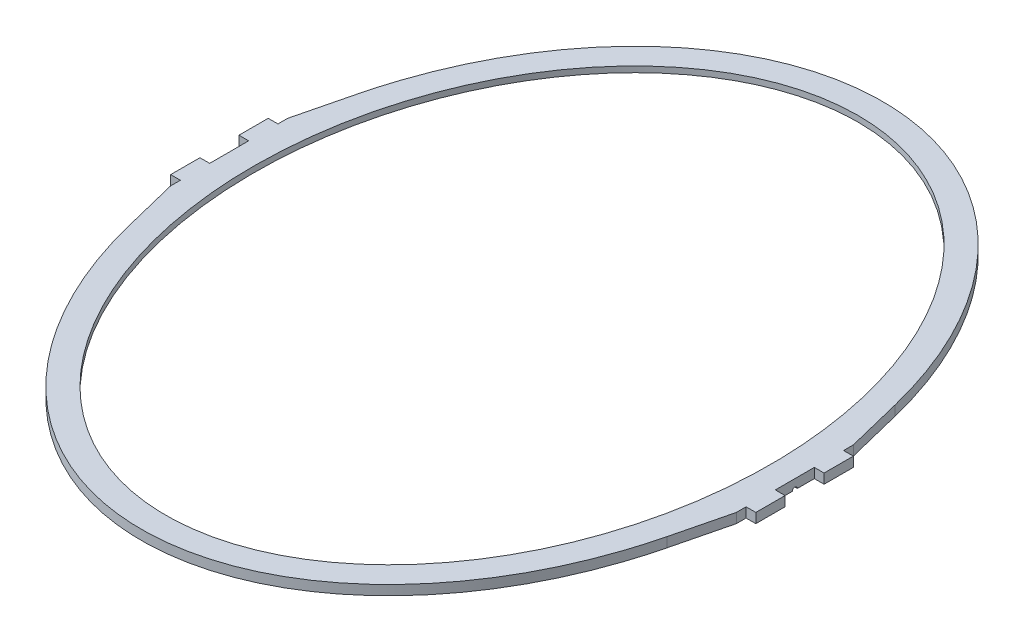
ISO-10303-21;
HEADER;
FILE_DESCRIPTION(('STEP AP214'),'2;1');
FILE_NAME('part.step','',(''),(''),'','','');
FILE_SCHEMA(('AUTOMOTIVE_DESIGN { 1 0 10303 214 1 1 1 1 }'));
ENDSEC;
DATA;
#1=APPLICATION_CONTEXT('core data for automotive mechanical design processes');
#2=APPLICATION_PROTOCOL_DEFINITION('international standard','automotive_design',2000,#1);
#3=PRODUCT_CONTEXT('',#1,'mechanical');
#4=PRODUCT('Part','Part','',(#3));
#5=PRODUCT_RELATED_PRODUCT_CATEGORY('part','',(#4));
#6=PRODUCT_DEFINITION_FORMATION('','',#4);
#7=PRODUCT_DEFINITION_CONTEXT('part definition',#1,'design');
#8=PRODUCT_DEFINITION('design','',#6,#7);
#9=PRODUCT_DEFINITION_SHAPE('','',#8);
#10=(LENGTH_UNIT() NAMED_UNIT(*) SI_UNIT(.MILLI.,.METRE.));
#11=(NAMED_UNIT(*) PLANE_ANGLE_UNIT() SI_UNIT($,.RADIAN.));
#12=(NAMED_UNIT(*) SI_UNIT($,.STERADIAN.) SOLID_ANGLE_UNIT());
#13=UNCERTAINTY_MEASURE_WITH_UNIT(LENGTH_MEASURE(1.E-05),#10,'distance_accuracy_value','');
#14=(GEOMETRIC_REPRESENTATION_CONTEXT(3) GLOBAL_UNCERTAINTY_ASSIGNED_CONTEXT((#13)) GLOBAL_UNIT_ASSIGNED_CONTEXT((#10,
#11,#12)) REPRESENTATION_CONTEXT('',''));
#15=CARTESIAN_POINT('',(0.,0.,0.));
#16=DIRECTION('',(0.,0.,1.));
#17=DIRECTION('',(1.,0.,0.));
#18=AXIS2_PLACEMENT_3D('',#15,#16,#17);
#19=CARTESIAN_POINT('',(0.,0.,0.));
#20=DIRECTION('',(0.,-1.,0.));
#21=DIRECTION('',(0.,0.,-1.));
#22=AXIS2_PLACEMENT_3D('',#19,#20,#21);
#23=PLANE('',#22);
#24=DIRECTION('',(1.,0.,0.));
#25=VECTOR('',#24,1.);
#26=CARTESIAN_POINT('',(280.,0.,-2.5));
#27=LINE('',#26,#25);
#28=CARTESIAN_POINT('',(280.,0.,-2.5));
#29=VERTEX_POINT('',#28);
#30=CARTESIAN_POINT('',(290.,0.,-2.5));
#31=VERTEX_POINT('',#30);
#32=EDGE_CURVE('E47',#29,#31,#27,.T.);
#33=ORIENTED_EDGE('',*,*,#32,.F.);
#34=DIRECTION('',(0.,0.,-1.));
#35=VECTOR('',#34,1.);
#36=CARTESIAN_POINT('',(280.,0.,2.5));
#37=LINE('',#36,#35);
#38=CARTESIAN_POINT('',(280.,0.,2.5));
#39=VERTEX_POINT('',#38);
#40=EDGE_CURVE('E225',#39,#29,#37,.T.);
#41=ORIENTED_EDGE('',*,*,#40,.F.);
#42=DIRECTION('',(1.,0.,0.));
#43=VECTOR('',#42,1.);
#44=CARTESIAN_POINT('',(280.,0.,2.5));
#45=LINE('',#44,#43);
#46=CARTESIAN_POINT('',(290.,0.,2.5));
#47=VERTEX_POINT('',#46);
#48=EDGE_CURVE('E215',#39,#47,#45,.T.);
#49=ORIENTED_EDGE('',*,*,#48,.T.);
#50=DIRECTION('',(0.,0.,-1.));
#51=VECTOR('',#50,1.);
#52=CARTESIAN_POINT('',(290.,0.,-20.));
#53=LINE('',#52,#51);
#54=CARTESIAN_POINT('',(290.,0.,20.));
#55=VERTEX_POINT('',#54);
#56=EDGE_CURVE('E407',#55,#47,#53,.T.);
#57=ORIENTED_EDGE('',*,*,#56,.F.);
#58=DIRECTION('',(-1.,0.,0.));
#59=VECTOR('',#58,1.);
#60=CARTESIAN_POINT('',(300.,0.,20.));
#61=LINE('',#60,#59);
#62=CARTESIAN_POINT('',(300.,0.,20.));
#63=VERTEX_POINT('',#62);
#64=EDGE_CURVE('E404',#63,#55,#61,.T.);
#65=ORIENTED_EDGE('',*,*,#64,.F.);
#66=DIRECTION('',(0.,0.,-1.));
#67=VECTOR('',#66,1.);
#68=CARTESIAN_POINT('',(300.,0.,50.));
#69=LINE('',#68,#67);
#70=CARTESIAN_POINT('',(300.,0.,50.));
#71=VERTEX_POINT('',#70);
#72=EDGE_CURVE('E402',#71,#63,#69,.T.);
#73=ORIENTED_EDGE('',*,*,#72,.F.);
#74=DIRECTION('',(1.,0.,0.));
#75=VECTOR('',#74,1.);
#76=CARTESIAN_POINT('',(290.,0.,50.));
#77=LINE('',#76,#75);
#78=CARTESIAN_POINT('',(290.,0.,50.));
#79=VERTEX_POINT('',#78);
#80=EDGE_CURVE('E400',#79,#71,#77,.T.);
#81=ORIENTED_EDGE('',*,*,#80,.F.);
#82=DIRECTION('',(0.,0.,-1.));
#83=VECTOR('',#82,1.);
#84=CARTESIAN_POINT('',(290.,0.,50.));
#85=LINE('',#84,#83);
#86=CARTESIAN_POINT('',(290.,0.,60.));
#87=VERTEX_POINT('',#86);
#88=EDGE_CURVE('E398',#87,#79,#85,.T.);
#89=ORIENTED_EDGE('',*,*,#88,.F.);
#90=DIRECTION('',(0.239939067208134,0.,-0.970787950083483));
#91=VECTOR('',#90,1.);
#92=CARTESIAN_POINT('',(290.,0.,60.));
#93=LINE('',#92,#91);
#94=CARTESIAN_POINT('',(275.891891891892,0.,117.081081081081));
#95=VERTEX_POINT('',#94);
#96=EDGE_CURVE('E396',#95,#87,#93,.T.);
#97=ORIENTED_EDGE('',*,*,#96,.F.);
#98=CARTESIAN_POINT('',(0.,0.,0.));
#99=DIRECTION('',(0.,1.,0.));
#100=DIRECTION('',(0.,0.,1.));
#101=AXIS2_PLACEMENT_3D('',#98,#99,#100);
#102=ELLIPSE('',#101,380.,290.);
#103=CARTESIAN_POINT('',(-275.891891891892,0.,117.081081081081));
#104=VERTEX_POINT('',#103);
#105=EDGE_CURVE('E394',#104,#95,#102,.T.);
#106=ORIENTED_EDGE('',*,*,#105,.F.);
#107=DIRECTION('',(0.239939067208134,0.,0.970787950083483));
#108=VECTOR('',#107,1.);
#109=CARTESIAN_POINT('',(-290.,0.,60.));
#110=LINE('',#109,#108);
#111=CARTESIAN_POINT('',(-290.,0.,60.));
#112=VERTEX_POINT('',#111);
#113=EDGE_CURVE('E392',#112,#104,#110,.T.);
#114=ORIENTED_EDGE('',*,*,#113,.F.);
#115=DIRECTION('',(0.,0.,1.));
#116=VECTOR('',#115,1.);
#117=CARTESIAN_POINT('',(-290.,0.,50.));
#118=LINE('',#117,#116);
#119=CARTESIAN_POINT('',(-290.,0.,50.));
#120=VERTEX_POINT('',#119);
#121=EDGE_CURVE('E390',#120,#112,#118,.T.);
#122=ORIENTED_EDGE('',*,*,#121,.F.);
#123=DIRECTION('',(1.,0.,0.));
#124=VECTOR('',#123,1.);
#125=CARTESIAN_POINT('',(-290.,0.,50.));
#126=LINE('',#125,#124);
#127=CARTESIAN_POINT('',(-300.,0.,50.));
#128=VERTEX_POINT('',#127);
#129=EDGE_CURVE('E388',#128,#120,#126,.T.);
#130=ORIENTED_EDGE('',*,*,#129,.F.);
#131=DIRECTION('',(0.,0.,1.));
#132=VECTOR('',#131,1.);
#133=CARTESIAN_POINT('',(-300.,0.,50.));
#134=LINE('',#133,#132);
#135=CARTESIAN_POINT('',(-300.,0.,20.));
#136=VERTEX_POINT('',#135);
#137=EDGE_CURVE('E386',#136,#128,#134,.T.);
#138=ORIENTED_EDGE('',*,*,#137,.F.);
#139=DIRECTION('',(-1.,0.,0.));
#140=VECTOR('',#139,1.);
#141=CARTESIAN_POINT('',(-300.,0.,20.));
#142=LINE('',#141,#140);
#143=CARTESIAN_POINT('',(-290.,0.,20.));
#144=VERTEX_POINT('',#143);
#145=EDGE_CURVE('E384',#144,#136,#142,.T.);
#146=ORIENTED_EDGE('',*,*,#145,.F.);
#147=DIRECTION('',(0.,0.,1.));
#148=VECTOR('',#147,1.);
#149=CARTESIAN_POINT('',(-290.,0.,-20.));
#150=LINE('',#149,#148);
#151=CARTESIAN_POINT('',(-290.,0.,2.5));
#152=VERTEX_POINT('',#151);
#153=EDGE_CURVE('E380',#152,#144,#150,.T.);
#154=ORIENTED_EDGE('',*,*,#153,.F.);
#155=DIRECTION('',(-1.,0.,0.));
#156=VECTOR('',#155,1.);
#157=CARTESIAN_POINT('',(-280.,0.,2.5));
#158=LINE('',#157,#156);
#159=CARTESIAN_POINT('',(-280.,0.,2.5));
#160=VERTEX_POINT('',#159);
#161=EDGE_CURVE('E55',#160,#152,#158,.T.);
#162=ORIENTED_EDGE('',*,*,#161,.F.);
#163=DIRECTION('',(0.,0.,1.));
#164=VECTOR('',#163,1.);
#165=CARTESIAN_POINT('',(-280.,0.,-20.));
#166=LINE('',#165,#164);
#167=CARTESIAN_POINT('',(-280.,0.,-2.5));
#168=VERTEX_POINT('',#167);
#169=EDGE_CURVE('E239',#168,#160,#166,.T.);
#170=ORIENTED_EDGE('',*,*,#169,.F.);
#171=DIRECTION('',(-1.,0.,0.));
#172=VECTOR('',#171,1.);
#173=CARTESIAN_POINT('',(-280.,0.,-2.5));
#174=LINE('',#173,#172);
#175=CARTESIAN_POINT('',(-290.,0.,-2.5));
#176=VERTEX_POINT('',#175);
#177=EDGE_CURVE('E242',#168,#176,#174,.T.);
#178=ORIENTED_EDGE('',*,*,#177,.T.);
#179=CARTESIAN_POINT('',(-290.,0.,-20.));
#180=VERTEX_POINT('',#179);
#181=EDGE_CURVE('E381',#180,#176,#150,.T.);
#182=ORIENTED_EDGE('',*,*,#181,.F.);
#183=DIRECTION('',(1.,0.,0.));
#184=VECTOR('',#183,1.);
#185=CARTESIAN_POINT('',(-300.,0.,-20.));
#186=LINE('',#185,#184);
#187=CARTESIAN_POINT('',(-300.,0.,-20.));
#188=VERTEX_POINT('',#187);
#189=EDGE_CURVE('E378',#188,#180,#186,.T.);
#190=ORIENTED_EDGE('',*,*,#189,.F.);
#191=DIRECTION('',(0.,0.,1.));
#192=VECTOR('',#191,1.);
#193=CARTESIAN_POINT('',(-300.,0.,-50.));
#194=LINE('',#193,#192);
#195=CARTESIAN_POINT('',(-300.,0.,-50.));
#196=VERTEX_POINT('',#195);
#197=EDGE_CURVE('E376',#196,#188,#194,.T.);
#198=ORIENTED_EDGE('',*,*,#197,.F.);
#199=DIRECTION('',(-1.,0.,0.));
#200=VECTOR('',#199,1.);
#201=CARTESIAN_POINT('',(-290.,0.,-50.));
#202=LINE('',#201,#200);
#203=CARTESIAN_POINT('',(-290.,0.,-50.));
#204=VERTEX_POINT('',#203);
#205=EDGE_CURVE('E374',#204,#196,#202,.T.);
#206=ORIENTED_EDGE('',*,*,#205,.F.);
#207=DIRECTION('',(0.,0.,1.));
#208=VECTOR('',#207,1.);
#209=CARTESIAN_POINT('',(-290.,0.,-50.));
#210=LINE('',#209,#208);
#211=CARTESIAN_POINT('',(-290.,0.,-60.));
#212=VERTEX_POINT('',#211);
#213=EDGE_CURVE('E276',#212,#204,#210,.T.);
#214=ORIENTED_EDGE('',*,*,#213,.F.);
#215=DIRECTION('',(-0.239939067208134,0.,0.970787950083483));
#216=VECTOR('',#215,1.);
#217=CARTESIAN_POINT('',(-290.,0.,-60.));
#218=LINE('',#217,#216);
#219=CARTESIAN_POINT('',(-275.891891891892,0.,-117.081081081081));
#220=VERTEX_POINT('',#219);
#221=EDGE_CURVE('E281',#220,#212,#218,.T.);
#222=ORIENTED_EDGE('',*,*,#221,.F.);
#223=CARTESIAN_POINT('',(0.,0.,0.));
#224=DIRECTION('',(0.,1.,0.));
#225=DIRECTION('',(0.,0.,-1.));
#226=AXIS2_PLACEMENT_3D('',#223,#224,#225);
#227=ELLIPSE('',#226,380.,290.);
#228=CARTESIAN_POINT('',(275.891891891892,0.,-117.081081081081));
#229=VERTEX_POINT('',#228);
#230=EDGE_CURVE('E419',#229,#220,#227,.T.);
#231=ORIENTED_EDGE('',*,*,#230,.F.);
#232=DIRECTION('',(-0.239939067208134,0.,-0.970787950083483));
#233=VECTOR('',#232,1.);
#234=CARTESIAN_POINT('',(290.,0.,-60.));
#235=LINE('',#234,#233);
#236=CARTESIAN_POINT('',(290.,0.,-60.));
#237=VERTEX_POINT('',#236);
#238=EDGE_CURVE('E417',#237,#229,#235,.T.);
#239=ORIENTED_EDGE('',*,*,#238,.F.);
#240=DIRECTION('',(0.,0.,-1.));
#241=VECTOR('',#240,1.);
#242=CARTESIAN_POINT('',(290.,0.,-50.));
#243=LINE('',#242,#241);
#244=CARTESIAN_POINT('',(290.,0.,-50.));
#245=VERTEX_POINT('',#244);
#246=EDGE_CURVE('E415',#245,#237,#243,.T.);
#247=ORIENTED_EDGE('',*,*,#246,.F.);
#248=DIRECTION('',(-1.,0.,0.));
#249=VECTOR('',#248,1.);
#250=CARTESIAN_POINT('',(290.,0.,-50.));
#251=LINE('',#250,#249);
#252=CARTESIAN_POINT('',(300.,0.,-50.));
#253=VERTEX_POINT('',#252);
#254=EDGE_CURVE('E413',#253,#245,#251,.T.);
#255=ORIENTED_EDGE('',*,*,#254,.F.);
#256=DIRECTION('',(0.,0.,-1.));
#257=VECTOR('',#256,1.);
#258=CARTESIAN_POINT('',(300.,0.,-50.));
#259=LINE('',#258,#257);
#260=CARTESIAN_POINT('',(300.,0.,-20.));
#261=VERTEX_POINT('',#260);
#262=EDGE_CURVE('E411',#261,#253,#259,.T.);
#263=ORIENTED_EDGE('',*,*,#262,.F.);
#264=DIRECTION('',(1.,0.,0.));
#265=VECTOR('',#264,1.);
#266=CARTESIAN_POINT('',(300.,0.,-20.));
#267=LINE('',#266,#265);
#268=CARTESIAN_POINT('',(290.,0.,-20.));
#269=VERTEX_POINT('',#268);
#270=EDGE_CURVE('E409',#269,#261,#267,.T.);
#271=ORIENTED_EDGE('',*,*,#270,.F.);
#272=EDGE_CURVE('E406',#31,#269,#53,.T.);
#273=ORIENTED_EDGE('',*,*,#272,.F.);
#274=EDGE_LOOP('',(#33,#41,#49,#57,#65,#73,#81,#89,#97,#106,#114,#122,#130,#138,#146,#154,#162,
#170,#178,#182,#190,#198,#206,#214,#222,#231,#239,#247,#255,#263,#271,#273));
#275=FACE_BOUND('',#274,.T.);
#276=CARTESIAN_POINT('',(0.,0.,0.));
#277=DIRECTION('',(0.,-1.,0.));
#278=DIRECTION('',(0.,0.,1.));
#279=AXIS2_PLACEMENT_3D('',#276,#277,#278);
#280=ELLIPSE('',#279,365.,275.);
#281=CARTESIAN_POINT('',(0.,0.,365.));
#282=VERTEX_POINT('',#281);
#283=EDGE_CURVE('E250',#282,#282,#280,.T.);
#284=ORIENTED_EDGE('',*,*,#283,.F.);
#285=EDGE_LOOP('',(#284));
#286=FACE_BOUND('',#285,.T.);
#287=ADVANCED_FACE('F32',(#275,#286),#23,.T.);
#288=CARTESIAN_POINT('',(-290.,10.,-20.));
#289=DIRECTION('',(1.,0.,0.));
#290=DIRECTION('',(0.,0.,-1.));
#291=AXIS2_PLACEMENT_3D('',#288,#289,#290);
#292=PLANE('',#291);
#293=CARTESIAN_POINT('',(-290.,0.,0.));
#294=DIRECTION('',(1.,0.,0.));
#295=DIRECTION('',(0.,0.,-1.));
#296=AXIS2_PLACEMENT_3D('',#293,#294,#295);
#297=CIRCLE('',#296,2.5);
#298=EDGE_CURVE('E235',#176,#152,#297,.T.);
#299=ORIENTED_EDGE('',*,*,#298,.T.);
#300=ORIENTED_EDGE('',*,*,#153,.T.);
#301=DIRECTION('',(0.,-1.,0.));
#302=VECTOR('',#301,1.);
#303=CARTESIAN_POINT('',(-290.,10.,20.));
#304=LINE('',#303,#302);
#305=CARTESIAN_POINT('',(-290.,10.,20.));
#306=VERTEX_POINT('',#305);
#307=EDGE_CURVE('E478',#306,#144,#304,.T.);
#308=ORIENTED_EDGE('',*,*,#307,.F.);
#309=DIRECTION('',(0.,0.,1.));
#310=VECTOR('',#309,1.);
#311=CARTESIAN_POINT('',(-290.,10.,-20.));
#312=LINE('',#311,#310);
#313=CARTESIAN_POINT('',(-290.,10.,-20.));
#314=VERTEX_POINT('',#313);
#315=EDGE_CURVE('E287',#314,#306,#312,.T.);
#316=ORIENTED_EDGE('',*,*,#315,.F.);
#317=DIRECTION('',(0.,-1.,0.));
#318=VECTOR('',#317,1.);
#319=CARTESIAN_POINT('',(-290.,10.,-20.));
#320=LINE('',#319,#318);
#321=EDGE_CURVE('E481',#314,#180,#320,.T.);
#322=ORIENTED_EDGE('',*,*,#321,.T.);
#323=ORIENTED_EDGE('',*,*,#181,.T.);
#324=EDGE_LOOP('',(#299,#300,#308,#316,#322,#323));
#325=FACE_BOUND('',#324,.T.);
#326=ADVANCED_FACE('F270',(#325),#292,.F.);
#327=CARTESIAN_POINT('',(0.,10.,0.));
#328=DIRECTION('',(0.,1.,0.));
#329=DIRECTION('',(0.,0.,-1.));
#330=AXIS2_PLACEMENT_3D('',#327,#328,#329);
#331=ELLIPSE('',#330,355.,265.);
#332=DIRECTION('',(0.,-1.,0.));
#333=VECTOR('',#332,1.);
#334=SURFACE_OF_LINEAR_EXTRUSION('',#331,#333);
#335=CARTESIAN_POINT('',(0.,10.,-355.));
#336=VERTEX_POINT('',#335);
#337=EDGE_CURVE('E255',#336,#336,#331,.T.);
#338=ORIENTED_EDGE('',*,*,#337,.T.);
#339=EDGE_LOOP('',(#338));
#340=FACE_BOUND('',#339,.T.);
#341=CARTESIAN_POINT('',(0.,4.,0.));
#342=DIRECTION('',(0.,-1.,0.));
#343=DIRECTION('',(0.,0.,1.));
#344=AXIS2_PLACEMENT_3D('',#341,#342,#343);
#345=ELLIPSE('',#344,355.,265.);
#346=CARTESIAN_POINT('',(0.,4.,355.));
#347=VERTEX_POINT('',#346);
#348=EDGE_CURVE('E247',#347,#347,#345,.T.);
#349=ORIENTED_EDGE('',*,*,#348,.T.);
#350=EDGE_LOOP('',(#349));
#351=FACE_BOUND('',#350,.T.);
#352=ADVANCED_FACE('F266',(#340,#351),#334,.T.);
#353=CARTESIAN_POINT('',(0.,10.,0.));
#354=DIRECTION('',(0.,-1.,0.));
#355=DIRECTION('',(0.,0.,-1.));
#356=AXIS2_PLACEMENT_3D('',#353,#354,#355);
#357=PLANE('',#356);
#358=DIRECTION('',(0.,0.,1.));
#359=VECTOR('',#358,1.);
#360=CARTESIAN_POINT('',(-290.,10.,-50.));
#361=LINE('',#360,#359);
#362=CARTESIAN_POINT('',(-290.,10.,-60.));
#363=VERTEX_POINT('',#362);
#364=CARTESIAN_POINT('',(-290.,10.,-50.));
#365=VERTEX_POINT('',#364);
#366=EDGE_CURVE('E277',#363,#365,#361,.T.);
#367=ORIENTED_EDGE('',*,*,#366,.T.);
#368=DIRECTION('',(-1.,0.,0.));
#369=VECTOR('',#368,1.);
#370=CARTESIAN_POINT('',(-290.,10.,-50.));
#371=LINE('',#370,#369);
#372=CARTESIAN_POINT('',(-300.,10.,-50.));
#373=VERTEX_POINT('',#372);
#374=EDGE_CURVE('E280',#365,#373,#371,.T.);
#375=ORIENTED_EDGE('',*,*,#374,.T.);
#376=DIRECTION('',(0.,0.,1.));
#377=VECTOR('',#376,1.);
#378=CARTESIAN_POINT('',(-300.,10.,-50.));
#379=LINE('',#378,#377);
#380=CARTESIAN_POINT('',(-300.,10.,-20.));
#381=VERTEX_POINT('',#380);
#382=EDGE_CURVE('E283',#373,#381,#379,.T.);
#383=ORIENTED_EDGE('',*,*,#382,.T.);
#384=DIRECTION('',(1.,0.,0.));
#385=VECTOR('',#384,1.);
#386=CARTESIAN_POINT('',(-300.,10.,-20.));
#387=LINE('',#386,#385);
#388=EDGE_CURVE('E285',#381,#314,#387,.T.);
#389=ORIENTED_EDGE('',*,*,#388,.T.);
#390=ORIENTED_EDGE('',*,*,#315,.T.);
#391=DIRECTION('',(-1.,0.,0.));
#392=VECTOR('',#391,1.);
#393=CARTESIAN_POINT('',(-300.,10.,20.));
#394=LINE('',#393,#392);
#395=CARTESIAN_POINT('',(-300.,10.,20.));
#396=VERTEX_POINT('',#395);
#397=EDGE_CURVE('E289',#306,#396,#394,.T.);
#398=ORIENTED_EDGE('',*,*,#397,.T.);
#399=DIRECTION('',(0.,0.,1.));
#400=VECTOR('',#399,1.);
#401=CARTESIAN_POINT('',(-300.,10.,50.));
#402=LINE('',#401,#400);
#403=CARTESIAN_POINT('',(-300.,10.,50.));
#404=VERTEX_POINT('',#403);
#405=EDGE_CURVE('E291',#396,#404,#402,.T.);
#406=ORIENTED_EDGE('',*,*,#405,.T.);
#407=DIRECTION('',(1.,0.,0.));
#408=VECTOR('',#407,1.);
#409=CARTESIAN_POINT('',(-290.,10.,50.));
#410=LINE('',#409,#408);
#411=CARTESIAN_POINT('',(-290.,10.,50.));
#412=VERTEX_POINT('',#411);
#413=EDGE_CURVE('E293',#404,#412,#410,.T.);
#414=ORIENTED_EDGE('',*,*,#413,.T.);
#415=DIRECTION('',(0.,0.,1.));
#416=VECTOR('',#415,1.);
#417=CARTESIAN_POINT('',(-290.,10.,50.));
#418=LINE('',#417,#416);
#419=CARTESIAN_POINT('',(-290.,10.,60.));
#420=VERTEX_POINT('',#419);
#421=EDGE_CURVE('E295',#412,#420,#418,.T.);
#422=ORIENTED_EDGE('',*,*,#421,.T.);
#423=DIRECTION('',(0.239939067208134,0.,0.970787950083483));
#424=VECTOR('',#423,1.);
#425=CARTESIAN_POINT('',(-290.,10.,60.));
#426=LINE('',#425,#424);
#427=CARTESIAN_POINT('',(-275.891891891892,10.,117.081081081081));
#428=VERTEX_POINT('',#427);
#429=EDGE_CURVE('E297',#420,#428,#426,.T.);
#430=ORIENTED_EDGE('',*,*,#429,.T.);
#431=CARTESIAN_POINT('',(0.,10.,0.));
#432=DIRECTION('',(0.,1.,0.));
#433=DIRECTION('',(0.,0.,1.));
#434=AXIS2_PLACEMENT_3D('',#431,#432,#433);
#435=ELLIPSE('',#434,380.,290.);
#436=CARTESIAN_POINT('',(275.891891891892,10.,117.081081081081));
#437=VERTEX_POINT('',#436);
#438=EDGE_CURVE('E299',#428,#437,#435,.T.);
#439=ORIENTED_EDGE('',*,*,#438,.T.);
#440=DIRECTION('',(0.239939067208134,0.,-0.970787950083483));
#441=VECTOR('',#440,1.);
#442=CARTESIAN_POINT('',(290.,10.,60.));
#443=LINE('',#442,#441);
#444=CARTESIAN_POINT('',(290.,10.,60.));
#445=VERTEX_POINT('',#444);
#446=EDGE_CURVE('E302',#437,#445,#443,.T.);
#447=ORIENTED_EDGE('',*,*,#446,.T.);
#448=DIRECTION('',(0.,0.,-1.));
#449=VECTOR('',#448,1.);
#450=CARTESIAN_POINT('',(290.,10.,50.));
#451=LINE('',#450,#449);
#452=CARTESIAN_POINT('',(290.,10.,50.));
#453=VERTEX_POINT('',#452);
#454=EDGE_CURVE('E569',#445,#453,#451,.T.);
#455=ORIENTED_EDGE('',*,*,#454,.T.);
#456=DIRECTION('',(1.,0.,0.));
#457=VECTOR('',#456,1.);
#458=CARTESIAN_POINT('',(290.,10.,50.));
#459=LINE('',#458,#457);
#460=CARTESIAN_POINT('',(300.,10.,50.));
#461=VERTEX_POINT('',#460);
#462=EDGE_CURVE('E560',#453,#461,#459,.T.);
#463=ORIENTED_EDGE('',*,*,#462,.T.);
#464=DIRECTION('',(0.,0.,-1.));
#465=VECTOR('',#464,1.);
#466=CARTESIAN_POINT('',(300.,10.,50.));
#467=LINE('',#466,#465);
#468=CARTESIAN_POINT('',(300.,10.,20.));
#469=VERTEX_POINT('',#468);
#470=EDGE_CURVE('E555',#461,#469,#467,.T.);
#471=ORIENTED_EDGE('',*,*,#470,.T.);
#472=DIRECTION('',(-1.,0.,0.));
#473=VECTOR('',#472,1.);
#474=CARTESIAN_POINT('',(300.,10.,20.));
#475=LINE('',#474,#473);
#476=CARTESIAN_POINT('',(290.,10.,20.));
#477=VERTEX_POINT('',#476);
#478=EDGE_CURVE('E551',#469,#477,#475,.T.);
#479=ORIENTED_EDGE('',*,*,#478,.T.);
#480=DIRECTION('',(0.,0.,-1.));
#481=VECTOR('',#480,1.);
#482=CARTESIAN_POINT('',(290.,10.,-20.));
#483=LINE('',#482,#481);
#484=CARTESIAN_POINT('',(290.,10.,-20.));
#485=VERTEX_POINT('',#484);
#486=EDGE_CURVE('E542',#477,#485,#483,.T.);
#487=ORIENTED_EDGE('',*,*,#486,.T.);
#488=DIRECTION('',(1.,0.,0.));
#489=VECTOR('',#488,1.);
#490=CARTESIAN_POINT('',(300.,10.,-20.));
#491=LINE('',#490,#489);
#492=CARTESIAN_POINT('',(300.,10.,-20.));
#493=VERTEX_POINT('',#492);
#494=EDGE_CURVE('E538',#485,#493,#491,.T.);
#495=ORIENTED_EDGE('',*,*,#494,.T.);
#496=DIRECTION('',(0.,0.,-1.));
#497=VECTOR('',#496,1.);
#498=CARTESIAN_POINT('',(300.,10.,-50.));
#499=LINE('',#498,#497);
#500=CARTESIAN_POINT('',(300.,10.,-50.));
#501=VERTEX_POINT('',#500);
#502=EDGE_CURVE('E531',#493,#501,#499,.T.);
#503=ORIENTED_EDGE('',*,*,#502,.T.);
#504=DIRECTION('',(-1.,0.,0.));
#505=VECTOR('',#504,1.);
#506=CARTESIAN_POINT('',(290.,10.,-50.));
#507=LINE('',#506,#505);
#508=CARTESIAN_POINT('',(290.,10.,-50.));
#509=VERTEX_POINT('',#508);
#510=EDGE_CURVE('E526',#501,#509,#507,.T.);
#511=ORIENTED_EDGE('',*,*,#510,.T.);
#512=DIRECTION('',(0.,0.,-1.));
#513=VECTOR('',#512,1.);
#514=CARTESIAN_POINT('',(290.,10.,-50.));
#515=LINE('',#514,#513);
#516=CARTESIAN_POINT('',(290.,10.,-60.));
#517=VERTEX_POINT('',#516);
#518=EDGE_CURVE('E522',#509,#517,#515,.T.);
#519=ORIENTED_EDGE('',*,*,#518,.T.);
#520=DIRECTION('',(-0.239939067208134,0.,-0.970787950083483));
#521=VECTOR('',#520,1.);
#522=CARTESIAN_POINT('',(290.,10.,-60.));
#523=LINE('',#522,#521);
#524=CARTESIAN_POINT('',(275.891891891892,10.,-117.081081081081));
#525=VERTEX_POINT('',#524);
#526=EDGE_CURVE('E368',#517,#525,#523,.T.);
#527=ORIENTED_EDGE('',*,*,#526,.T.);
#528=CARTESIAN_POINT('',(0.,10.,0.));
#529=DIRECTION('',(0.,1.,0.));
#530=DIRECTION('',(0.,0.,-1.));
#531=AXIS2_PLACEMENT_3D('',#528,#529,#530);
#532=ELLIPSE('',#531,380.,290.);
#533=CARTESIAN_POINT('',(-275.891891891892,10.,-117.081081081081));
#534=VERTEX_POINT('',#533);
#535=EDGE_CURVE('E363',#525,#534,#532,.T.);
#536=ORIENTED_EDGE('',*,*,#535,.T.);
#537=DIRECTION('',(-0.239939067208134,0.,0.970787950083483));
#538=VECTOR('',#537,1.);
#539=CARTESIAN_POINT('',(-290.,10.,-60.));
#540=LINE('',#539,#538);
#541=EDGE_CURVE('E367',#534,#363,#540,.T.);
#542=ORIENTED_EDGE('',*,*,#541,.T.);
#543=EDGE_LOOP('',(#367,#375,#383,#389,#390,#398,#406,#414,#422,#430,#439,#447,#455,#463,#471,
#479,#487,#495,#503,#511,#519,#527,#536,#542));
#544=FACE_BOUND('',#543,.T.);
#545=ORIENTED_EDGE('',*,*,#337,.F.);
#546=EDGE_LOOP('',(#545));
#547=FACE_BOUND('',#546,.T.);
#548=ADVANCED_FACE('F269',(#544,#547),#357,.F.);
#549=CARTESIAN_POINT('',(-290.,10.,-50.));
#550=DIRECTION('',(1.,0.,0.));
#551=DIRECTION('',(0.,0.,-1.));
#552=AXIS2_PLACEMENT_3D('',#549,#550,#551);
#553=PLANE('',#552);
#554=ORIENTED_EDGE('',*,*,#213,.T.);
#555=DIRECTION('',(0.,-1.,0.));
#556=VECTOR('',#555,1.);
#557=CARTESIAN_POINT('',(-290.,10.,-50.));
#558=LINE('',#557,#556);
#559=EDGE_CURVE('E11',#365,#204,#558,.T.);
#560=ORIENTED_EDGE('',*,*,#559,.F.);
#561=ORIENTED_EDGE('',*,*,#366,.F.);
#562=DIRECTION('',(0.,-1.,0.));
#563=VECTOR('',#562,1.);
#564=CARTESIAN_POINT('',(-290.,10.,-60.));
#565=LINE('',#564,#563);
#566=EDGE_CURVE('E371',#363,#212,#565,.T.);
#567=ORIENTED_EDGE('',*,*,#566,.T.);
#568=EDGE_LOOP('',(#554,#560,#561,#567));
#569=FACE_BOUND('',#568,.T.);
#570=ADVANCED_FACE('F34',(#569),#553,.F.);
#571=CARTESIAN_POINT('',(-290.,10.,-50.));
#572=DIRECTION('',(0.,0.,1.));
#573=DIRECTION('',(1.,0.,0.));
#574=AXIS2_PLACEMENT_3D('',#571,#572,#573);
#575=PLANE('',#574);
#576=ORIENTED_EDGE('',*,*,#205,.T.);
#577=DIRECTION('',(0.,-1.,0.));
#578=VECTOR('',#577,1.);
#579=CARTESIAN_POINT('',(-300.,10.,-50.));
#580=LINE('',#579,#578);
#581=EDGE_CURVE('E40',#373,#196,#580,.T.);
#582=ORIENTED_EDGE('',*,*,#581,.F.);
#583=ORIENTED_EDGE('',*,*,#374,.F.);
#584=ORIENTED_EDGE('',*,*,#559,.T.);
#585=EDGE_LOOP('',(#576,#582,#583,#584));
#586=FACE_BOUND('',#585,.T.);
#587=ADVANCED_FACE('F341',(#586),#575,.F.);
#588=CARTESIAN_POINT('',(-300.,10.,-50.));
#589=DIRECTION('',(1.,0.,0.));
#590=DIRECTION('',(0.,0.,-1.));
#591=AXIS2_PLACEMENT_3D('',#588,#589,#590);
#592=PLANE('',#591);
#593=ORIENTED_EDGE('',*,*,#197,.T.);
#594=DIRECTION('',(0.,-1.,0.));
#595=VECTOR('',#594,1.);
#596=CARTESIAN_POINT('',(-300.,10.,-20.));
#597=LINE('',#596,#595);
#598=EDGE_CURVE('E484',#381,#188,#597,.T.);
#599=ORIENTED_EDGE('',*,*,#598,.F.);
#600=ORIENTED_EDGE('',*,*,#382,.F.);
#601=ORIENTED_EDGE('',*,*,#581,.T.);
#602=EDGE_LOOP('',(#593,#599,#600,#601));
#603=FACE_BOUND('',#602,.T.);
#604=ADVANCED_FACE('F338',(#603),#592,.F.);
#605=CARTESIAN_POINT('',(-300.,10.,-20.));
#606=DIRECTION('',(0.,0.,-1.));
#607=DIRECTION('',(-1.,0.,0.));
#608=AXIS2_PLACEMENT_3D('',#605,#606,#607);
#609=PLANE('',#608);
#610=ORIENTED_EDGE('',*,*,#189,.T.);
#611=ORIENTED_EDGE('',*,*,#321,.F.);
#612=ORIENTED_EDGE('',*,*,#388,.F.);
#613=ORIENTED_EDGE('',*,*,#598,.T.);
#614=EDGE_LOOP('',(#610,#611,#612,#613));
#615=FACE_BOUND('',#614,.T.);
#616=ADVANCED_FACE('F331',(#615),#609,.F.);
#617=CARTESIAN_POINT('',(-300.,10.,20.));
#618=DIRECTION('',(0.,0.,1.));
#619=DIRECTION('',(1.,0.,0.));
#620=AXIS2_PLACEMENT_3D('',#617,#618,#619);
#621=PLANE('',#620);
#622=ORIENTED_EDGE('',*,*,#145,.T.);
#623=DIRECTION('',(0.,-1.,0.));
#624=VECTOR('',#623,1.);
#625=CARTESIAN_POINT('',(-300.,10.,20.));
#626=LINE('',#625,#624);
#627=EDGE_CURVE('E475',#396,#136,#626,.T.);
#628=ORIENTED_EDGE('',*,*,#627,.F.);
#629=ORIENTED_EDGE('',*,*,#397,.F.);
#630=ORIENTED_EDGE('',*,*,#307,.T.);
#631=EDGE_LOOP('',(#622,#628,#629,#630));
#632=FACE_BOUND('',#631,.T.);
#633=ADVANCED_FACE('F327',(#632),#621,.F.);
#634=CARTESIAN_POINT('',(-300.,10.,50.));
#635=DIRECTION('',(1.,0.,0.));
#636=DIRECTION('',(0.,0.,-1.));
#637=AXIS2_PLACEMENT_3D('',#634,#635,#636);
#638=PLANE('',#637);
#639=ORIENTED_EDGE('',*,*,#137,.T.);
#640=DIRECTION('',(0.,-1.,0.));
#641=VECTOR('',#640,1.);
#642=CARTESIAN_POINT('',(-300.,10.,50.));
#643=LINE('',#642,#641);
#644=EDGE_CURVE('E472',#404,#128,#643,.T.);
#645=ORIENTED_EDGE('',*,*,#644,.F.);
#646=ORIENTED_EDGE('',*,*,#405,.F.);
#647=ORIENTED_EDGE('',*,*,#627,.T.);
#648=EDGE_LOOP('',(#639,#645,#646,#647));
#649=FACE_BOUND('',#648,.T.);
#650=ADVANCED_FACE('F323',(#649),#638,.F.);
#651=CARTESIAN_POINT('',(-290.,10.,50.));
#652=DIRECTION('',(0.,0.,-1.));
#653=DIRECTION('',(-1.,0.,0.));
#654=AXIS2_PLACEMENT_3D('',#651,#652,#653);
#655=PLANE('',#654);
#656=ORIENTED_EDGE('',*,*,#129,.T.);
#657=DIRECTION('',(0.,-1.,0.));
#658=VECTOR('',#657,1.);
#659=CARTESIAN_POINT('',(-290.,10.,50.));
#660=LINE('',#659,#658);
#661=EDGE_CURVE('E469',#412,#120,#660,.T.);
#662=ORIENTED_EDGE('',*,*,#661,.F.);
#663=ORIENTED_EDGE('',*,*,#413,.F.);
#664=ORIENTED_EDGE('',*,*,#644,.T.);
#665=EDGE_LOOP('',(#656,#662,#663,#664));
#666=FACE_BOUND('',#665,.T.);
#667=ADVANCED_FACE('F319',(#666),#655,.F.);
#668=CARTESIAN_POINT('',(-290.,10.,50.));
#669=DIRECTION('',(1.,0.,0.));
#670=DIRECTION('',(0.,0.,-1.));
#671=AXIS2_PLACEMENT_3D('',#668,#669,#670);
#672=PLANE('',#671);
#673=ORIENTED_EDGE('',*,*,#121,.T.);
#674=DIRECTION('',(0.,-1.,0.));
#675=VECTOR('',#674,1.);
#676=CARTESIAN_POINT('',(-290.,10.,60.));
#677=LINE('',#676,#675);
#678=EDGE_CURVE('E466',#420,#112,#677,.T.);
#679=ORIENTED_EDGE('',*,*,#678,.F.);
#680=ORIENTED_EDGE('',*,*,#421,.F.);
#681=ORIENTED_EDGE('',*,*,#661,.T.);
#682=EDGE_LOOP('',(#673,#679,#680,#681));
#683=FACE_BOUND('',#682,.T.);
#684=ADVANCED_FACE('F315',(#683),#672,.F.);
#685=CARTESIAN_POINT('',(-290.,10.,60.));
#686=DIRECTION('',(0.970787950083483,0.,-0.239939067208134));
#687=DIRECTION('',(-0.239939067208134,0.,-0.970787950083483));
#688=AXIS2_PLACEMENT_3D('',#685,#686,#687);
#689=PLANE('',#688);
#690=ORIENTED_EDGE('',*,*,#113,.T.);
#691=DIRECTION('',(0.,-1.,0.));
#692=VECTOR('',#691,1.);
#693=CARTESIAN_POINT('',(-275.891891891892,10.,117.081081081081));
#694=LINE('',#693,#692);
#695=EDGE_CURVE('E463',#428,#104,#694,.T.);
#696=ORIENTED_EDGE('',*,*,#695,.F.);
#697=ORIENTED_EDGE('',*,*,#429,.F.);
#698=ORIENTED_EDGE('',*,*,#678,.T.);
#699=EDGE_LOOP('',(#690,#696,#697,#698));
#700=FACE_BOUND('',#699,.T.);
#701=ADVANCED_FACE('F310',(#700),#689,.F.);
#702=DIRECTION('',(0.,-1.,0.));
#703=VECTOR('',#702,1.);
#704=SURFACE_OF_LINEAR_EXTRUSION('',#435,#703);
#705=ORIENTED_EDGE('',*,*,#105,.T.);
#706=DIRECTION('',(0.,-1.,0.));
#707=VECTOR('',#706,1.);
#708=CARTESIAN_POINT('',(275.891891891892,10.,117.081081081081));
#709=LINE('',#708,#707);
#710=EDGE_CURVE('E460',#437,#95,#709,.T.);
#711=ORIENTED_EDGE('',*,*,#710,.F.);
#712=ORIENTED_EDGE('',*,*,#438,.F.);
#713=ORIENTED_EDGE('',*,*,#695,.T.);
#714=EDGE_LOOP('',(#705,#711,#712,#713));
#715=FACE_BOUND('',#714,.T.);
#716=ADVANCED_FACE('F305',(#715),#704,.F.);
#717=CARTESIAN_POINT('',(290.,10.,60.));
#718=DIRECTION('',(-0.970787950083483,0.,-0.239939067208134));
#719=DIRECTION('',(-0.239939067208134,0.,0.970787950083483));
#720=AXIS2_PLACEMENT_3D('',#717,#718,#719);
#721=PLANE('',#720);
#722=ORIENTED_EDGE('',*,*,#96,.T.);
#723=DIRECTION('',(0.,-1.,0.));
#724=VECTOR('',#723,1.);
#725=CARTESIAN_POINT('',(290.,10.,60.));
#726=LINE('',#725,#724);
#727=EDGE_CURVE('E457',#445,#87,#726,.T.);
#728=ORIENTED_EDGE('',*,*,#727,.F.);
#729=ORIENTED_EDGE('',*,*,#446,.F.);
#730=ORIENTED_EDGE('',*,*,#710,.T.);
#731=EDGE_LOOP('',(#722,#728,#729,#730));
#732=FACE_BOUND('',#731,.T.);
#733=ADVANCED_FACE('F309',(#732),#721,.F.);
#734=CARTESIAN_POINT('',(290.,10.,50.));
#735=DIRECTION('',(-1.,0.,0.));
#736=DIRECTION('',(0.,0.,1.));
#737=AXIS2_PLACEMENT_3D('',#734,#735,#736);
#738=PLANE('',#737);
#739=ORIENTED_EDGE('',*,*,#88,.T.);
#740=DIRECTION('',(0.,-1.,0.));
#741=VECTOR('',#740,1.);
#742=CARTESIAN_POINT('',(290.,10.,50.));
#743=LINE('',#742,#741);
#744=EDGE_CURVE('E454',#453,#79,#743,.T.);
#745=ORIENTED_EDGE('',*,*,#744,.F.);
#746=ORIENTED_EDGE('',*,*,#454,.F.);
#747=ORIENTED_EDGE('',*,*,#727,.T.);
#748=EDGE_LOOP('',(#739,#745,#746,#747));
#749=FACE_BOUND('',#748,.T.);
#750=ADVANCED_FACE('F566',(#749),#738,.F.);
#751=CARTESIAN_POINT('',(290.,10.,50.));
#752=DIRECTION('',(0.,0.,-1.));
#753=DIRECTION('',(-1.,0.,0.));
#754=AXIS2_PLACEMENT_3D('',#751,#752,#753);
#755=PLANE('',#754);
#756=ORIENTED_EDGE('',*,*,#80,.T.);
#757=DIRECTION('',(0.,-1.,0.));
#758=VECTOR('',#757,1.);
#759=CARTESIAN_POINT('',(300.,10.,50.));
#760=LINE('',#759,#758);
#761=EDGE_CURVE('E451',#461,#71,#760,.T.);
#762=ORIENTED_EDGE('',*,*,#761,.F.);
#763=ORIENTED_EDGE('',*,*,#462,.F.);
#764=ORIENTED_EDGE('',*,*,#744,.T.);
#765=EDGE_LOOP('',(#756,#762,#763,#764));
#766=FACE_BOUND('',#765,.T.);
#767=ADVANCED_FACE('F559',(#766),#755,.F.);
#768=CARTESIAN_POINT('',(300.,10.,50.));
#769=DIRECTION('',(-1.,0.,0.));
#770=DIRECTION('',(0.,0.,1.));
#771=AXIS2_PLACEMENT_3D('',#768,#769,#770);
#772=PLANE('',#771);
#773=ORIENTED_EDGE('',*,*,#72,.T.);
#774=DIRECTION('',(0.,-1.,0.));
#775=VECTOR('',#774,1.);
#776=CARTESIAN_POINT('',(300.,10.,20.));
#777=LINE('',#776,#775);
#778=EDGE_CURVE('E448',#469,#63,#777,.T.);
#779=ORIENTED_EDGE('',*,*,#778,.F.);
#780=ORIENTED_EDGE('',*,*,#470,.F.);
#781=ORIENTED_EDGE('',*,*,#761,.T.);
#782=EDGE_LOOP('',(#773,#779,#780,#781));
#783=FACE_BOUND('',#782,.T.);
#784=ADVANCED_FACE('F554',(#783),#772,.F.);
#785=CARTESIAN_POINT('',(300.,10.,20.));
#786=DIRECTION('',(0.,0.,1.));
#787=DIRECTION('',(1.,0.,0.));
#788=AXIS2_PLACEMENT_3D('',#785,#786,#787);
#789=PLANE('',#788);
#790=ORIENTED_EDGE('',*,*,#64,.T.);
#791=DIRECTION('',(0.,-1.,0.));
#792=VECTOR('',#791,1.);
#793=CARTESIAN_POINT('',(290.,10.,20.));
#794=LINE('',#793,#792);
#795=EDGE_CURVE('E445',#477,#55,#794,.T.);
#796=ORIENTED_EDGE('',*,*,#795,.F.);
#797=ORIENTED_EDGE('',*,*,#478,.F.);
#798=ORIENTED_EDGE('',*,*,#778,.T.);
#799=EDGE_LOOP('',(#790,#796,#797,#798));
#800=FACE_BOUND('',#799,.T.);
#801=ADVANCED_FACE('F548',(#800),#789,.F.);
#802=CARTESIAN_POINT('',(290.,10.,-20.));
#803=DIRECTION('',(-1.,0.,0.));
#804=DIRECTION('',(0.,0.,1.));
#805=AXIS2_PLACEMENT_3D('',#802,#803,#804);
#806=PLANE('',#805);
#807=ORIENTED_EDGE('',*,*,#56,.T.);
#808=CARTESIAN_POINT('',(290.,0.,0.));
#809=DIRECTION('',(1.,0.,0.));
#810=DIRECTION('',(0.,0.,-1.));
#811=AXIS2_PLACEMENT_3D('',#808,#809,#810);
#812=CIRCLE('',#811,2.5);
#813=EDGE_CURVE('E220',#31,#47,#812,.T.);
#814=ORIENTED_EDGE('',*,*,#813,.F.);
#815=ORIENTED_EDGE('',*,*,#272,.T.);
#816=DIRECTION('',(0.,-1.,0.));
#817=VECTOR('',#816,1.);
#818=CARTESIAN_POINT('',(290.,10.,-20.));
#819=LINE('',#818,#817);
#820=EDGE_CURVE('E442',#485,#269,#819,.T.);
#821=ORIENTED_EDGE('',*,*,#820,.F.);
#822=ORIENTED_EDGE('',*,*,#486,.F.);
#823=ORIENTED_EDGE('',*,*,#795,.T.);
#824=EDGE_LOOP('',(#807,#814,#815,#821,#822,#823));
#825=FACE_BOUND('',#824,.T.);
#826=ADVANCED_FACE('F541',(#825),#806,.F.);
#827=CARTESIAN_POINT('',(300.,10.,-20.));
#828=DIRECTION('',(0.,0.,-1.));
#829=DIRECTION('',(-1.,0.,0.));
#830=AXIS2_PLACEMENT_3D('',#827,#828,#829);
#831=PLANE('',#830);
#832=ORIENTED_EDGE('',*,*,#270,.T.);
#833=DIRECTION('',(0.,-1.,0.));
#834=VECTOR('',#833,1.);
#835=CARTESIAN_POINT('',(300.,10.,-20.));
#836=LINE('',#835,#834);
#837=EDGE_CURVE('E439',#493,#261,#836,.T.);
#838=ORIENTED_EDGE('',*,*,#837,.F.);
#839=ORIENTED_EDGE('',*,*,#494,.F.);
#840=ORIENTED_EDGE('',*,*,#820,.T.);
#841=EDGE_LOOP('',(#832,#838,#839,#840));
#842=FACE_BOUND('',#841,.T.);
#843=ADVANCED_FACE('F535',(#842),#831,.F.);
#844=CARTESIAN_POINT('',(300.,10.,-50.));
#845=DIRECTION('',(-1.,0.,0.));
#846=DIRECTION('',(0.,0.,1.));
#847=AXIS2_PLACEMENT_3D('',#844,#845,#846);
#848=PLANE('',#847);
#849=ORIENTED_EDGE('',*,*,#262,.T.);
#850=DIRECTION('',(0.,-1.,0.));
#851=VECTOR('',#850,1.);
#852=CARTESIAN_POINT('',(300.,10.,-50.));
#853=LINE('',#852,#851);
#854=EDGE_CURVE('E436',#501,#253,#853,.T.);
#855=ORIENTED_EDGE('',*,*,#854,.F.);
#856=ORIENTED_EDGE('',*,*,#502,.F.);
#857=ORIENTED_EDGE('',*,*,#837,.T.);
#858=EDGE_LOOP('',(#849,#855,#856,#857));
#859=FACE_BOUND('',#858,.T.);
#860=ADVANCED_FACE('F530',(#859),#848,.F.);
#861=CARTESIAN_POINT('',(290.,10.,-50.));
#862=DIRECTION('',(0.,0.,1.));
#863=DIRECTION('',(1.,0.,0.));
#864=AXIS2_PLACEMENT_3D('',#861,#862,#863);
#865=PLANE('',#864);
#866=ORIENTED_EDGE('',*,*,#254,.T.);
#867=DIRECTION('',(0.,-1.,0.));
#868=VECTOR('',#867,1.);
#869=CARTESIAN_POINT('',(290.,10.,-50.));
#870=LINE('',#869,#868);
#871=EDGE_CURVE('E433',#509,#245,#870,.T.);
#872=ORIENTED_EDGE('',*,*,#871,.F.);
#873=ORIENTED_EDGE('',*,*,#510,.F.);
#874=ORIENTED_EDGE('',*,*,#854,.T.);
#875=EDGE_LOOP('',(#866,#872,#873,#874));
#876=FACE_BOUND('',#875,.T.);
#877=ADVANCED_FACE('F525',(#876),#865,.F.);
#878=CARTESIAN_POINT('',(290.,10.,-50.));
#879=DIRECTION('',(-1.,0.,0.));
#880=DIRECTION('',(0.,0.,1.));
#881=AXIS2_PLACEMENT_3D('',#878,#879,#880);
#882=PLANE('',#881);
#883=ORIENTED_EDGE('',*,*,#246,.T.);
#884=DIRECTION('',(0.,-1.,0.));
#885=VECTOR('',#884,1.);
#886=CARTESIAN_POINT('',(290.,10.,-60.));
#887=LINE('',#886,#885);
#888=EDGE_CURVE('E430',#517,#237,#887,.T.);
#889=ORIENTED_EDGE('',*,*,#888,.F.);
#890=ORIENTED_EDGE('',*,*,#518,.F.);
#891=ORIENTED_EDGE('',*,*,#871,.T.);
#892=EDGE_LOOP('',(#883,#889,#890,#891));
#893=FACE_BOUND('',#892,.T.);
#894=ADVANCED_FACE('F519',(#893),#882,.F.);
#895=CARTESIAN_POINT('',(290.,10.,-60.));
#896=DIRECTION('',(-0.970787950083483,0.,0.239939067208134));
#897=DIRECTION('',(0.239939067208134,0.,0.970787950083483));
#898=AXIS2_PLACEMENT_3D('',#895,#896,#897);
#899=PLANE('',#898);
#900=ORIENTED_EDGE('',*,*,#238,.T.);
#901=DIRECTION('',(0.,-1.,0.));
#902=VECTOR('',#901,1.);
#903=CARTESIAN_POINT('',(275.891891891892,10.,-117.081081081081));
#904=LINE('',#903,#902);
#905=EDGE_CURVE('E427',#525,#229,#904,.T.);
#906=ORIENTED_EDGE('',*,*,#905,.F.);
#907=ORIENTED_EDGE('',*,*,#526,.F.);
#908=ORIENTED_EDGE('',*,*,#888,.T.);
#909=EDGE_LOOP('',(#900,#906,#907,#908));
#910=FACE_BOUND('',#909,.T.);
#911=ADVANCED_FACE('F360',(#910),#899,.F.);
#912=DIRECTION('',(0.,-1.,0.));
#913=VECTOR('',#912,1.);
#914=SURFACE_OF_LINEAR_EXTRUSION('',#532,#913);
#915=ORIENTED_EDGE('',*,*,#230,.T.);
#916=DIRECTION('',(0.,-1.,0.));
#917=VECTOR('',#916,1.);
#918=CARTESIAN_POINT('',(-275.891891891892,10.,-117.081081081081));
#919=LINE('',#918,#917);
#920=EDGE_CURVE('E424',#534,#220,#919,.T.);
#921=ORIENTED_EDGE('',*,*,#920,.F.);
#922=ORIENTED_EDGE('',*,*,#535,.F.);
#923=ORIENTED_EDGE('',*,*,#905,.T.);
#924=EDGE_LOOP('',(#915,#921,#922,#923));
#925=FACE_BOUND('',#924,.T.);
#926=ADVANCED_FACE('F355',(#925),#914,.F.);
#927=CARTESIAN_POINT('',(-290.,10.,-60.));
#928=DIRECTION('',(0.970787950083483,0.,0.239939067208134));
#929=DIRECTION('',(0.239939067208134,0.,-0.970787950083483));
#930=AXIS2_PLACEMENT_3D('',#927,#928,#929);
#931=PLANE('',#930);
#932=ORIENTED_EDGE('',*,*,#221,.T.);
#933=ORIENTED_EDGE('',*,*,#566,.F.);
#934=ORIENTED_EDGE('',*,*,#541,.F.);
#935=ORIENTED_EDGE('',*,*,#920,.T.);
#936=EDGE_LOOP('',(#932,#933,#934,#935));
#937=FACE_BOUND('',#936,.T.);
#938=ADVANCED_FACE('F263',(#937),#931,.F.);
#939=CARTESIAN_POINT('',(0.,4.,0.));
#940=DIRECTION('',(0.,-1.,0.));
#941=DIRECTION('',(0.,0.,1.));
#942=AXIS2_PLACEMENT_3D('',#939,#940,#941);
#943=ELLIPSE('',#942,365.,275.);
#944=DIRECTION('',(0.,-1.,0.));
#945=VECTOR('',#944,1.);
#946=SURFACE_OF_LINEAR_EXTRUSION('',#943,#945);
#947=CARTESIAN_POINT('',(0.,4.,365.));
#948=VERTEX_POINT('',#947);
#949=EDGE_CURVE('E251',#948,#948,#943,.T.);
#950=ORIENTED_EDGE('',*,*,#949,.F.);
#951=EDGE_LOOP('',(#950));
#952=FACE_BOUND('',#951,.T.);
#953=ORIENTED_EDGE('',*,*,#283,.T.);
#954=EDGE_LOOP('',(#953));
#955=FACE_BOUND('',#954,.T.);
#956=ADVANCED_FACE('F258',(#952,#955),#946,.F.);
#957=CARTESIAN_POINT('',(0.,4.,0.));
#958=DIRECTION('',(0.,-1.,0.));
#959=DIRECTION('',(0.,0.,-1.));
#960=AXIS2_PLACEMENT_3D('',#957,#958,#959);
#961=PLANE('',#960);
#962=ORIENTED_EDGE('',*,*,#348,.F.);
#963=EDGE_LOOP('',(#962));
#964=FACE_BOUND('',#963,.T.);
#965=ORIENTED_EDGE('',*,*,#949,.T.);
#966=EDGE_LOOP('',(#965));
#967=FACE_BOUND('',#966,.T.);
#968=ADVANCED_FACE('F262',(#964,#967),#961,.T.);
#969=CARTESIAN_POINT('',(-280.,0.,0.));
#970=DIRECTION('',(-1.,0.,0.));
#971=DIRECTION('',(0.,0.,1.));
#972=AXIS2_PLACEMENT_3D('',#969,#970,#971);
#973=CYLINDRICAL_SURFACE('',#972,2.5);
#974=ORIENTED_EDGE('',*,*,#298,.F.);
#975=ORIENTED_EDGE('',*,*,#177,.F.);
#976=CARTESIAN_POINT('',(-280.,0.,0.));
#977=DIRECTION('',(1.,0.,0.));
#978=DIRECTION('',(0.,0.,-1.));
#979=AXIS2_PLACEMENT_3D('',#976,#977,#978);
#980=CIRCLE('',#979,2.5);
#981=EDGE_CURVE('E237',#168,#160,#980,.T.);
#982=ORIENTED_EDGE('',*,*,#981,.T.);
#983=ORIENTED_EDGE('',*,*,#161,.T.);
#984=EDGE_LOOP('',(#974,#975,#982,#983));
#985=FACE_BOUND('',#984,.T.);
#986=ADVANCED_FACE('F596',(#985),#973,.F.);
#987=CARTESIAN_POINT('',(-280.,0.,0.));
#988=DIRECTION('',(1.,0.,0.));
#989=DIRECTION('',(0.,0.,-1.));
#990=AXIS2_PLACEMENT_3D('',#987,#988,#989);
#991=PLANE('',#990);
#992=ORIENTED_EDGE('',*,*,#981,.F.);
#993=ORIENTED_EDGE('',*,*,#169,.T.);
#994=EDGE_LOOP('',(#992,#993));
#995=FACE_BOUND('',#994,.T.);
#996=ADVANCED_FACE('F599',(#995),#991,.F.);
#997=CARTESIAN_POINT('',(280.,0.,0.));
#998=DIRECTION('',(1.,0.,0.));
#999=DIRECTION('',(0.,0.,-1.));
#1000=AXIS2_PLACEMENT_3D('',#997,#998,#999);
#1001=CYLINDRICAL_SURFACE('',#1000,2.5);
#1002=ORIENTED_EDGE('',*,*,#813,.T.);
#1003=ORIENTED_EDGE('',*,*,#48,.F.);
#1004=CARTESIAN_POINT('',(280.,0.,0.));
#1005=DIRECTION('',(1.,0.,0.));
#1006=DIRECTION('',(0.,0.,-1.));
#1007=AXIS2_PLACEMENT_3D('',#1004,#1005,#1006);
#1008=CIRCLE('',#1007,2.5);
#1009=EDGE_CURVE('E218',#29,#39,#1008,.T.);
#1010=ORIENTED_EDGE('',*,*,#1009,.F.);
#1011=ORIENTED_EDGE('',*,*,#32,.T.);
#1012=EDGE_LOOP('',(#1002,#1003,#1010,#1011));
#1013=FACE_BOUND('',#1012,.T.);
#1014=ADVANCED_FACE('F217',(#1013),#1001,.F.);
#1015=CARTESIAN_POINT('',(280.,0.,0.));
#1016=DIRECTION('',(1.,0.,0.));
#1017=DIRECTION('',(0.,0.,-1.));
#1018=AXIS2_PLACEMENT_3D('',#1015,#1016,#1017);
#1019=PLANE('',#1018);
#1020=ORIENTED_EDGE('',*,*,#1009,.T.);
#1021=ORIENTED_EDGE('',*,*,#40,.T.);
#1022=EDGE_LOOP('',(#1020,#1021));
#1023=FACE_BOUND('',#1022,.T.);
#1024=ADVANCED_FACE('F228',(#1023),#1019,.T.);
#1025=CLOSED_SHELL('',(#287,#326,#352,#548,#570,#587,#604,#616,#633,#650,#667,#684,#701,#716,
#733,#750,#767,#784,#801,#826,#843,#860,#877,#894,#911,#926,#938,#956,#968,#986,#996,#1014,#1024));
#1026=MANIFOLD_SOLID_BREP('B2',#1025);
#1027=ADVANCED_BREP_SHAPE_REPRESENTATION('',(#18,#1026),#14);
#1028=SHAPE_DEFINITION_REPRESENTATION(#9,#1027);
ENDSEC;
END-ISO-10303-21;
